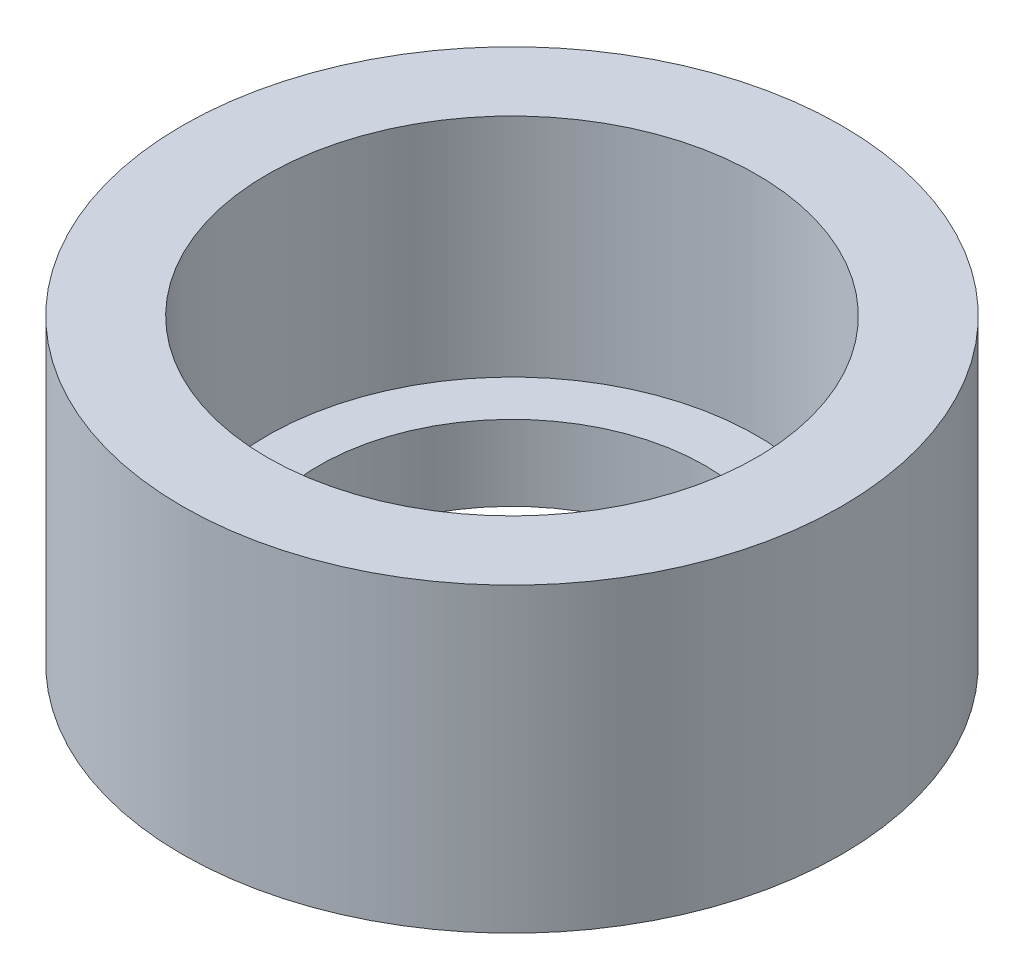
ISO-10303-21;
HEADER;
FILE_DESCRIPTION(('STEP AP214'),'2;1');
FILE_NAME('part.step','',(''),(''),'','','');
FILE_SCHEMA(('AUTOMOTIVE_DESIGN { 1 0 10303 214 1 1 1 1 }'));
ENDSEC;
DATA;
#1=APPLICATION_CONTEXT('core data for automotive mechanical design processes');
#2=APPLICATION_PROTOCOL_DEFINITION('international standard','automotive_design',2000,#1);
#3=PRODUCT_CONTEXT('',#1,'mechanical');
#4=PRODUCT('Part','Part','',(#3));
#5=PRODUCT_RELATED_PRODUCT_CATEGORY('part','',(#4));
#6=PRODUCT_DEFINITION_FORMATION('','',#4);
#7=PRODUCT_DEFINITION_CONTEXT('part definition',#1,'design');
#8=PRODUCT_DEFINITION('design','',#6,#7);
#9=PRODUCT_DEFINITION_SHAPE('','',#8);
#10=(LENGTH_UNIT() NAMED_UNIT(*) SI_UNIT(.MILLI.,.METRE.));
#11=(NAMED_UNIT(*) PLANE_ANGLE_UNIT() SI_UNIT($,.RADIAN.));
#12=(NAMED_UNIT(*) SI_UNIT($,.STERADIAN.) SOLID_ANGLE_UNIT());
#13=UNCERTAINTY_MEASURE_WITH_UNIT(LENGTH_MEASURE(1.E-05),#10,'distance_accuracy_value','');
#14=(GEOMETRIC_REPRESENTATION_CONTEXT(3) GLOBAL_UNCERTAINTY_ASSIGNED_CONTEXT((#13)) GLOBAL_UNIT_ASSIGNED_CONTEXT((#10,
#11,#12)) REPRESENTATION_CONTEXT('',''));
#15=CARTESIAN_POINT('',(0.,0.,0.));
#16=DIRECTION('',(0.,0.,1.));
#17=DIRECTION('',(1.,0.,0.));
#18=AXIS2_PLACEMENT_3D('',#15,#16,#17);
#19=CARTESIAN_POINT('',(0.,8.,0.));
#20=DIRECTION('',(0.,-1.,0.));
#21=DIRECTION('',(0.,0.,-1.));
#22=AXIS2_PLACEMENT_3D('',#19,#20,#21);
#23=CYLINDRICAL_SURFACE('',#22,5.125);
#24=CARTESIAN_POINT('',(0.,0.,0.));
#25=DIRECTION('',(0.,1.,0.));
#26=DIRECTION('',(0.,0.,1.));
#27=AXIS2_PLACEMENT_3D('',#24,#25,#26);
#28=CIRCLE('',#27,5.125);
#29=CARTESIAN_POINT('',(0.,0.,5.125));
#30=VERTEX_POINT('',#29);
#31=EDGE_CURVE('E44',#30,#30,#28,.T.);
#32=ORIENTED_EDGE('',*,*,#31,.F.);
#33=EDGE_LOOP('',(#32));
#34=FACE_BOUND('',#33,.T.);
#35=CARTESIAN_POINT('',(0.,2.,0.));
#36=DIRECTION('',(0.,1.,0.));
#37=DIRECTION('',(0.,0.,1.));
#38=AXIS2_PLACEMENT_3D('',#35,#36,#37);
#39=CIRCLE('',#38,5.125);
#40=CARTESIAN_POINT('',(0.,2.,5.125));
#41=VERTEX_POINT('',#40);
#42=EDGE_CURVE('E35',#41,#41,#39,.T.);
#43=ORIENTED_EDGE('',*,*,#42,.T.);
#44=EDGE_LOOP('',(#43));
#45=FACE_BOUND('',#44,.T.);
#46=ADVANCED_FACE('F31',(#34,#45),#23,.F.);
#47=CARTESIAN_POINT('',(0.,8.,0.));
#48=DIRECTION('',(0.,1.,0.));
#49=DIRECTION('',(0.,0.,1.));
#50=AXIS2_PLACEMENT_3D('',#47,#48,#49);
#51=PLANE('',#50);
#52=CARTESIAN_POINT('',(0.,8.,0.));
#53=DIRECTION('',(0.,1.,0.));
#54=DIRECTION('',(0.,0.,1.));
#55=AXIS2_PLACEMENT_3D('',#52,#53,#54);
#56=CIRCLE('',#55,6.5);
#57=CARTESIAN_POINT('',(0.,8.,6.5));
#58=VERTEX_POINT('',#57);
#59=EDGE_CURVE('E48',#58,#58,#56,.T.);
#60=ORIENTED_EDGE('',*,*,#59,.F.);
#61=EDGE_LOOP('',(#60));
#62=FACE_BOUND('',#61,.T.);
#63=CARTESIAN_POINT('',(0.,8.,0.));
#64=DIRECTION('',(0.,1.,0.));
#65=DIRECTION('',(0.,0.,1.));
#66=AXIS2_PLACEMENT_3D('',#63,#64,#65);
#67=CIRCLE('',#66,8.75);
#68=CARTESIAN_POINT('',(0.,8.,8.75));
#69=VERTEX_POINT('',#68);
#70=EDGE_CURVE('E10',#69,#69,#67,.T.);
#71=ORIENTED_EDGE('',*,*,#70,.T.);
#72=EDGE_LOOP('',(#71));
#73=FACE_BOUND('',#72,.T.);
#74=ADVANCED_FACE('F69',(#62,#73),#51,.T.);
#75=CARTESIAN_POINT('',(0.,0.,0.));
#76=DIRECTION('',(0.,1.,0.));
#77=DIRECTION('',(0.,0.,1.));
#78=AXIS2_PLACEMENT_3D('',#75,#76,#77);
#79=PLANE('',#78);
#80=CARTESIAN_POINT('',(0.,0.,0.));
#81=DIRECTION('',(0.,1.,0.));
#82=DIRECTION('',(0.,0.,1.));
#83=AXIS2_PLACEMENT_3D('',#80,#81,#82);
#84=CIRCLE('',#83,8.75);
#85=CARTESIAN_POINT('',(0.,0.,8.75));
#86=VERTEX_POINT('',#85);
#87=EDGE_CURVE('E39',#86,#86,#84,.T.);
#88=ORIENTED_EDGE('',*,*,#87,.F.);
#89=EDGE_LOOP('',(#88));
#90=FACE_BOUND('',#89,.T.);
#91=ORIENTED_EDGE('',*,*,#31,.T.);
#92=EDGE_LOOP('',(#91));
#93=FACE_BOUND('',#92,.T.);
#94=ADVANCED_FACE('F76',(#90,#93),#79,.F.);
#95=CARTESIAN_POINT('',(0.,8.,0.));
#96=DIRECTION('',(0.,-1.,0.));
#97=DIRECTION('',(0.,0.,-1.));
#98=AXIS2_PLACEMENT_3D('',#95,#96,#97);
#99=CYLINDRICAL_SURFACE('',#98,8.75);
#100=ORIENTED_EDGE('',*,*,#70,.F.);
#101=EDGE_LOOP('',(#100));
#102=FACE_BOUND('',#101,.T.);
#103=ORIENTED_EDGE('',*,*,#87,.T.);
#104=EDGE_LOOP('',(#103));
#105=FACE_BOUND('',#104,.T.);
#106=ADVANCED_FACE('F33',(#102,#105),#99,.T.);
#107=CARTESIAN_POINT('',(0.,2.,0.));
#108=DIRECTION('',(0.,1.,0.));
#109=DIRECTION('',(0.,0.,1.));
#110=AXIS2_PLACEMENT_3D('',#107,#108,#109);
#111=CYLINDRICAL_SURFACE('',#110,6.5);
#112=CARTESIAN_POINT('',(0.,2.,0.));
#113=DIRECTION('',(0.,1.,0.));
#114=DIRECTION('',(0.,0.,1.));
#115=AXIS2_PLACEMENT_3D('',#112,#113,#114);
#116=CIRCLE('',#115,6.5);
#117=CARTESIAN_POINT('',(0.,2.,6.5));
#118=VERTEX_POINT('',#117);
#119=EDGE_CURVE('E51',#118,#118,#116,.T.);
#120=ORIENTED_EDGE('',*,*,#119,.F.);
#121=EDGE_LOOP('',(#120));
#122=FACE_BOUND('',#121,.T.);
#123=ORIENTED_EDGE('',*,*,#59,.T.);
#124=EDGE_LOOP('',(#123));
#125=FACE_BOUND('',#124,.T.);
#126=ADVANCED_FACE('F61',(#122,#125),#111,.F.);
#127=CARTESIAN_POINT('',(0.,2.,0.));
#128=DIRECTION('',(0.,1.,0.));
#129=DIRECTION('',(0.,0.,1.));
#130=AXIS2_PLACEMENT_3D('',#127,#128,#129);
#131=PLANE('',#130);
#132=ORIENTED_EDGE('',*,*,#42,.F.);
#133=EDGE_LOOP('',(#132));
#134=FACE_BOUND('',#133,.T.);
#135=ORIENTED_EDGE('',*,*,#119,.T.);
#136=EDGE_LOOP('',(#135));
#137=FACE_BOUND('',#136,.T.);
#138=ADVANCED_FACE('F59',(#134,#137),#131,.T.);
#139=CLOSED_SHELL('',(#46,#74,#94,#106,#126,#138));
#140=MANIFOLD_SOLID_BREP('B2',#139);
#141=ADVANCED_BREP_SHAPE_REPRESENTATION('',(#18,#140),#14);
#142=SHAPE_DEFINITION_REPRESENTATION(#9,#141);
ENDSEC;
END-ISO-10303-21;
